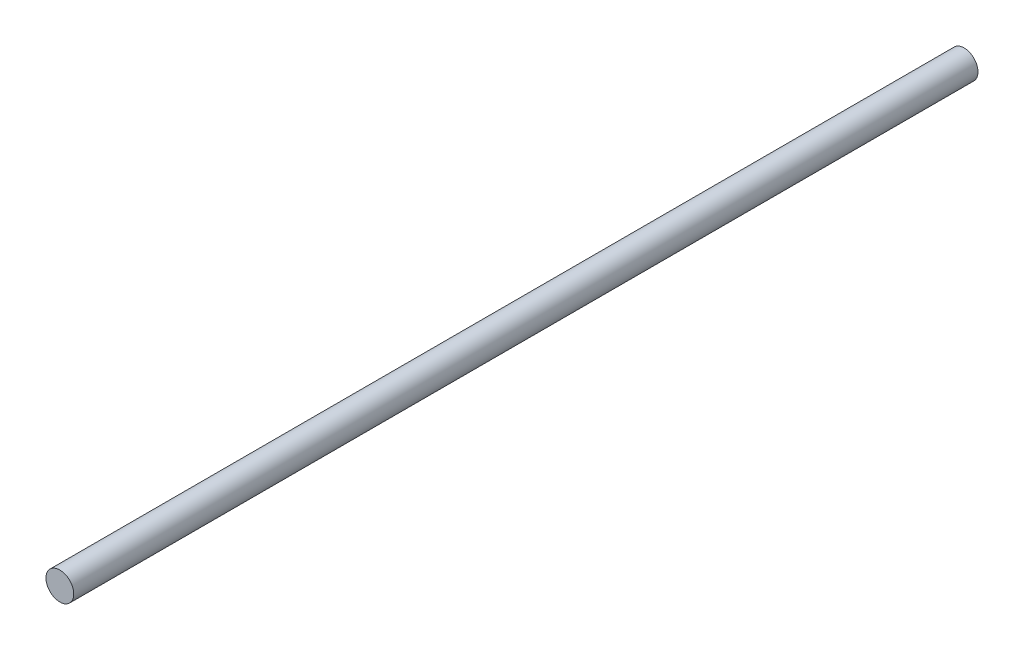
ISO-10303-21;
HEADER;
FILE_DESCRIPTION(('STEP AP214'),'2;1');
FILE_NAME('part.step','',(''),(''),'','','');
FILE_SCHEMA(('AUTOMOTIVE_DESIGN { 1 0 10303 214 1 1 1 1 }'));
ENDSEC;
DATA;
#1=APPLICATION_CONTEXT('core data for automotive mechanical design processes');
#2=APPLICATION_PROTOCOL_DEFINITION('international standard','automotive_design',2000,#1);
#3=PRODUCT_CONTEXT('',#1,'mechanical');
#4=PRODUCT('Part','Part','',(#3));
#5=PRODUCT_RELATED_PRODUCT_CATEGORY('part','',(#4));
#6=PRODUCT_DEFINITION_FORMATION('','',#4);
#7=PRODUCT_DEFINITION_CONTEXT('part definition',#1,'design');
#8=PRODUCT_DEFINITION('design','',#6,#7);
#9=PRODUCT_DEFINITION_SHAPE('','',#8);
#10=(LENGTH_UNIT() NAMED_UNIT(*) SI_UNIT(.MILLI.,.METRE.));
#11=(NAMED_UNIT(*) PLANE_ANGLE_UNIT() SI_UNIT($,.RADIAN.));
#12=(NAMED_UNIT(*) SI_UNIT($,.STERADIAN.) SOLID_ANGLE_UNIT());
#13=UNCERTAINTY_MEASURE_WITH_UNIT(LENGTH_MEASURE(1.E-05),#10,'distance_accuracy_value','');
#14=(GEOMETRIC_REPRESENTATION_CONTEXT(3) GLOBAL_UNCERTAINTY_ASSIGNED_CONTEXT((#13)) GLOBAL_UNIT_ASSIGNED_CONTEXT((#10,
#11,#12)) REPRESENTATION_CONTEXT('',''));
#15=CARTESIAN_POINT('',(0.,0.,0.));
#16=DIRECTION('',(0.,0.,1.));
#17=DIRECTION('',(1.,0.,0.));
#18=AXIS2_PLACEMENT_3D('',#15,#16,#17);
#19=CARTESIAN_POINT('',(0.,0.,521.));
#20=DIRECTION('',(0.,0.,-1.));
#21=DIRECTION('',(-1.,0.,0.));
#22=AXIS2_PLACEMENT_3D('',#19,#20,#21);
#23=CYLINDRICAL_SURFACE('',#22,8.00000000000001);
#24=CARTESIAN_POINT('',(0.,0.,521.));
#25=DIRECTION('',(0.,0.,1.));
#26=DIRECTION('',(1.,0.,0.));
#27=AXIS2_PLACEMENT_3D('',#24,#25,#26);
#28=CIRCLE('',#27,8.00000000000001);
#29=CARTESIAN_POINT('',(8.00000000000001,0.,521.));
#30=VERTEX_POINT('',#29);
#31=EDGE_CURVE('E10',#30,#30,#28,.T.);
#32=ORIENTED_EDGE('',*,*,#31,.F.);
#33=EDGE_LOOP('',(#32));
#34=FACE_BOUND('',#33,.T.);
#35=CARTESIAN_POINT('',(0.,0.,0.));
#36=DIRECTION('',(0.,0.,1.));
#37=DIRECTION('',(1.,0.,0.));
#38=AXIS2_PLACEMENT_3D('',#35,#36,#37);
#39=CIRCLE('',#38,8.00000000000001);
#40=CARTESIAN_POINT('',(8.00000000000001,0.,0.));
#41=VERTEX_POINT('',#40);
#42=EDGE_CURVE('E40',#41,#41,#39,.T.);
#43=ORIENTED_EDGE('',*,*,#42,.T.);
#44=EDGE_LOOP('',(#43));
#45=FACE_BOUND('',#44,.T.);
#46=ADVANCED_FACE('F37',(#34,#45),#23,.T.);
#47=CARTESIAN_POINT('',(0.,0.,521.));
#48=DIRECTION('',(0.,0.,1.));
#49=DIRECTION('',(1.,0.,0.));
#50=AXIS2_PLACEMENT_3D('',#47,#48,#49);
#51=PLANE('',#50);
#52=ORIENTED_EDGE('',*,*,#31,.T.);
#53=EDGE_LOOP('',(#52));
#54=FACE_BOUND('',#53,.T.);
#55=ADVANCED_FACE('F54',(#54),#51,.T.);
#56=CARTESIAN_POINT('',(0.,0.,0.));
#57=DIRECTION('',(0.,0.,1.));
#58=DIRECTION('',(1.,0.,0.));
#59=AXIS2_PLACEMENT_3D('',#56,#57,#58);
#60=PLANE('',#59);
#61=ORIENTED_EDGE('',*,*,#42,.F.);
#62=EDGE_LOOP('',(#61));
#63=FACE_BOUND('',#62,.T.);
#64=ADVANCED_FACE('F52',(#63),#60,.F.);
#65=CLOSED_SHELL('',(#46,#55,#64));
#66=MANIFOLD_SOLID_BREP('B2',#65);
#67=ADVANCED_BREP_SHAPE_REPRESENTATION('',(#18,#66),#14);
#68=SHAPE_DEFINITION_REPRESENTATION(#9,#67);
ENDSEC;
END-ISO-10303-21;
